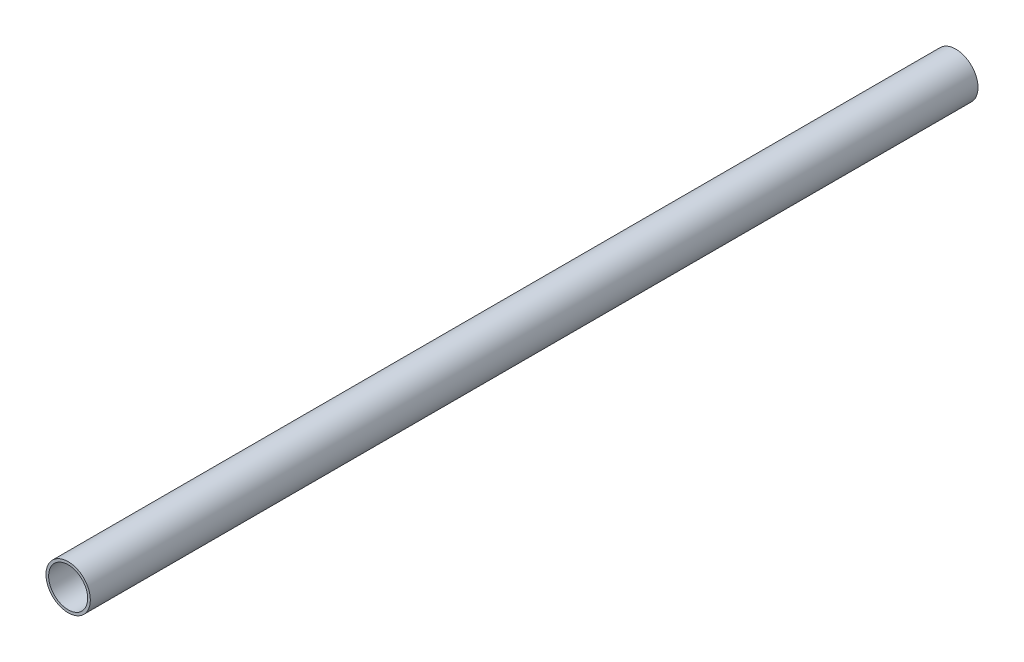
ISO-10303-21;
HEADER;
FILE_DESCRIPTION(('STEP AP214'),'2;1');
FILE_NAME('part.step','',(''),(''),'','','');
FILE_SCHEMA(('AUTOMOTIVE_DESIGN { 1 0 10303 214 1 1 1 1 }'));
ENDSEC;
DATA;
#1=APPLICATION_CONTEXT('core data for automotive mechanical design processes');
#2=APPLICATION_PROTOCOL_DEFINITION('international standard','automotive_design',2000,#1);
#3=PRODUCT_CONTEXT('',#1,'mechanical');
#4=PRODUCT('Part','Part','',(#3));
#5=PRODUCT_RELATED_PRODUCT_CATEGORY('part','',(#4));
#6=PRODUCT_DEFINITION_FORMATION('','',#4);
#7=PRODUCT_DEFINITION_CONTEXT('part definition',#1,'design');
#8=PRODUCT_DEFINITION('design','',#6,#7);
#9=PRODUCT_DEFINITION_SHAPE('','',#8);
#10=(LENGTH_UNIT() NAMED_UNIT(*) SI_UNIT(.MILLI.,.METRE.));
#11=(NAMED_UNIT(*) PLANE_ANGLE_UNIT() SI_UNIT($,.RADIAN.));
#12=(NAMED_UNIT(*) SI_UNIT($,.STERADIAN.) SOLID_ANGLE_UNIT());
#13=UNCERTAINTY_MEASURE_WITH_UNIT(LENGTH_MEASURE(1.E-05),#10,'distance_accuracy_value','');
#14=(GEOMETRIC_REPRESENTATION_CONTEXT(3) GLOBAL_UNCERTAINTY_ASSIGNED_CONTEXT((#13)) GLOBAL_UNIT_ASSIGNED_CONTEXT((#10,
#11,#12)) REPRESENTATION_CONTEXT('',''));
#15=CARTESIAN_POINT('',(0.,0.,0.));
#16=DIRECTION('',(0.,0.,1.));
#17=DIRECTION('',(1.,0.,0.));
#18=AXIS2_PLACEMENT_3D('',#15,#16,#17);
#19=CARTESIAN_POINT('',(0.,0.,1000.));
#20=DIRECTION('',(0.,0.,1.));
#21=DIRECTION('',(1.,0.,0.));
#22=AXIS2_PLACEMENT_3D('',#19,#20,#21);
#23=PLANE('',#22);
#24=CARTESIAN_POINT('',(0.,0.,1000.));
#25=DIRECTION('',(0.,0.,1.));
#26=DIRECTION('',(1.,0.,0.));
#27=AXIS2_PLACEMENT_3D('',#24,#25,#26);
#28=CIRCLE('',#27,25.);
#29=CARTESIAN_POINT('',(25.,0.,1000.));
#30=VERTEX_POINT('',#29);
#31=EDGE_CURVE('E10',#30,#30,#28,.T.);
#32=ORIENTED_EDGE('',*,*,#31,.T.);
#33=EDGE_LOOP('',(#32));
#34=FACE_BOUND('',#33,.T.);
#35=CARTESIAN_POINT('',(0.,0.,1000.));
#36=DIRECTION('',(0.,0.,1.));
#37=DIRECTION('',(1.,0.,0.));
#38=AXIS2_PLACEMENT_3D('',#35,#36,#37);
#39=CIRCLE('',#38,22.);
#40=CARTESIAN_POINT('',(22.,0.,1000.));
#41=VERTEX_POINT('',#40);
#42=EDGE_CURVE('E46',#41,#41,#39,.T.);
#43=ORIENTED_EDGE('',*,*,#42,.F.);
#44=EDGE_LOOP('',(#43));
#45=FACE_BOUND('',#44,.T.);
#46=ADVANCED_FACE('F35',(#34,#45),#23,.T.);
#47=CARTESIAN_POINT('',(0.,0.,0.));
#48=DIRECTION('',(0.,0.,1.));
#49=DIRECTION('',(1.,0.,0.));
#50=AXIS2_PLACEMENT_3D('',#47,#48,#49);
#51=PLANE('',#50);
#52=CARTESIAN_POINT('',(0.,0.,0.));
#53=DIRECTION('',(0.,0.,1.));
#54=DIRECTION('',(1.,0.,0.));
#55=AXIS2_PLACEMENT_3D('',#52,#53,#54);
#56=CIRCLE('',#55,25.);
#57=CARTESIAN_POINT('',(25.,0.,0.));
#58=VERTEX_POINT('',#57);
#59=EDGE_CURVE('E39',#58,#58,#56,.T.);
#60=ORIENTED_EDGE('',*,*,#59,.F.);
#61=EDGE_LOOP('',(#60));
#62=FACE_BOUND('',#61,.T.);
#63=CARTESIAN_POINT('',(0.,0.,0.));
#64=DIRECTION('',(0.,0.,1.));
#65=DIRECTION('',(1.,0.,0.));
#66=AXIS2_PLACEMENT_3D('',#63,#64,#65);
#67=CIRCLE('',#66,22.);
#68=CARTESIAN_POINT('',(22.,0.,0.));
#69=VERTEX_POINT('',#68);
#70=EDGE_CURVE('E48',#69,#69,#67,.T.);
#71=ORIENTED_EDGE('',*,*,#70,.T.);
#72=EDGE_LOOP('',(#71));
#73=FACE_BOUND('',#72,.T.);
#74=ADVANCED_FACE('F58',(#62,#73),#51,.F.);
#75=CARTESIAN_POINT('',(0.,0.,1000.));
#76=DIRECTION('',(0.,0.,-1.));
#77=DIRECTION('',(-1.,0.,0.));
#78=AXIS2_PLACEMENT_3D('',#75,#76,#77);
#79=CYLINDRICAL_SURFACE('',#78,25.);
#80=ORIENTED_EDGE('',*,*,#31,.F.);
#81=EDGE_LOOP('',(#80));
#82=FACE_BOUND('',#81,.T.);
#83=ORIENTED_EDGE('',*,*,#59,.T.);
#84=EDGE_LOOP('',(#83));
#85=FACE_BOUND('',#84,.T.);
#86=ADVANCED_FACE('F37',(#82,#85),#79,.T.);
#87=CARTESIAN_POINT('',(0.,0.,1000.));
#88=DIRECTION('',(0.,0.,-1.));
#89=DIRECTION('',(-1.,0.,0.));
#90=AXIS2_PLACEMENT_3D('',#87,#88,#89);
#91=CYLINDRICAL_SURFACE('',#90,22.);
#92=ORIENTED_EDGE('',*,*,#42,.T.);
#93=EDGE_LOOP('',(#92));
#94=FACE_BOUND('',#93,.T.);
#95=ORIENTED_EDGE('',*,*,#70,.F.);
#96=EDGE_LOOP('',(#95));
#97=FACE_BOUND('',#96,.T.);
#98=ADVANCED_FACE('F54',(#94,#97),#91,.F.);
#99=CLOSED_SHELL('',(#46,#74,#86,#98));
#100=MANIFOLD_SOLID_BREP('B2',#99);
#101=ADVANCED_BREP_SHAPE_REPRESENTATION('',(#18,#100),#14);
#102=SHAPE_DEFINITION_REPRESENTATION(#9,#101);
ENDSEC;
END-ISO-10303-21;
